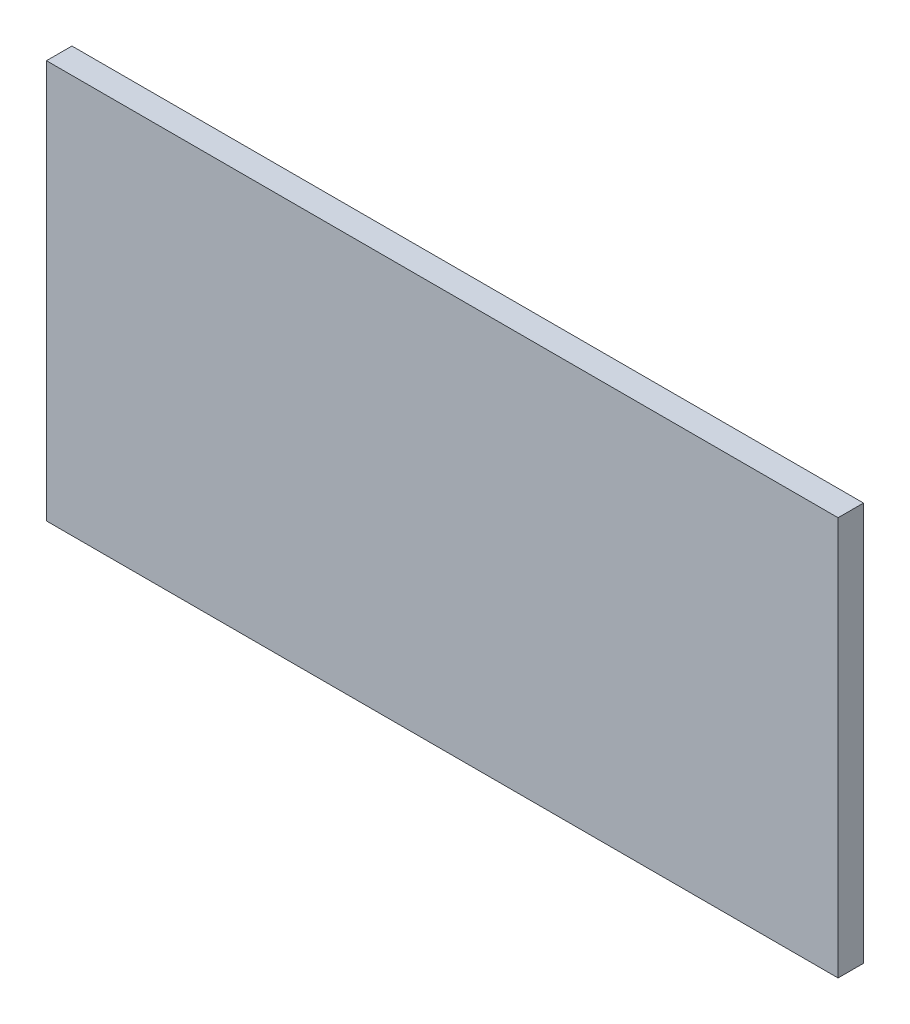
ISO-10303-21;
HEADER;
FILE_DESCRIPTION(('STEP AP214'),'2;1');
FILE_NAME('part.step','',(''),(''),'','','');
FILE_SCHEMA(('AUTOMOTIVE_DESIGN { 1 0 10303 214 1 1 1 1 }'));
ENDSEC;
DATA;
#1=APPLICATION_CONTEXT('core data for automotive mechanical design processes');
#2=APPLICATION_PROTOCOL_DEFINITION('international standard','automotive_design',2000,#1);
#3=PRODUCT_CONTEXT('',#1,'mechanical');
#4=PRODUCT('Part','Part','',(#3));
#5=PRODUCT_RELATED_PRODUCT_CATEGORY('part','',(#4));
#6=PRODUCT_DEFINITION_FORMATION('','',#4);
#7=PRODUCT_DEFINITION_CONTEXT('part definition',#1,'design');
#8=PRODUCT_DEFINITION('design','',#6,#7);
#9=PRODUCT_DEFINITION_SHAPE('','',#8);
#10=(LENGTH_UNIT() NAMED_UNIT(*) SI_UNIT(.MILLI.,.METRE.));
#11=(NAMED_UNIT(*) PLANE_ANGLE_UNIT() SI_UNIT($,.RADIAN.));
#12=(NAMED_UNIT(*) SI_UNIT($,.STERADIAN.) SOLID_ANGLE_UNIT());
#13=UNCERTAINTY_MEASURE_WITH_UNIT(LENGTH_MEASURE(1.E-05),#10,'distance_accuracy_value','');
#14=(GEOMETRIC_REPRESENTATION_CONTEXT(3) GLOBAL_UNCERTAINTY_ASSIGNED_CONTEXT((#13)) GLOBAL_UNIT_ASSIGNED_CONTEXT((#10,
#11,#12)) REPRESENTATION_CONTEXT('',''));
#15=CARTESIAN_POINT('',(0.,0.,0.));
#16=DIRECTION('',(0.,0.,1.));
#17=DIRECTION('',(1.,0.,0.));
#18=AXIS2_PLACEMENT_3D('',#15,#16,#17);
#19=CARTESIAN_POINT('',(-140.,0.,391.498006373246));
#20=DIRECTION('',(1.,0.,0.));
#21=DIRECTION('',(0.,0.,-1.));
#22=AXIS2_PLACEMENT_3D('',#19,#20,#21);
#23=PLANE('',#22);
#24=DIRECTION('',(0.,0.,-1.));
#25=VECTOR('',#24,1.);
#26=CARTESIAN_POINT('',(-140.,-66.,391.498006373246));
#27=LINE('',#26,#25);
#28=CARTESIAN_POINT('',(-140.,-66.,78.));
#29=VERTEX_POINT('',#28);
#30=CARTESIAN_POINT('',(-140.,-66.,69.));
#31=VERTEX_POINT('',#30);
#32=EDGE_CURVE('E70',#29,#31,#27,.T.);
#33=ORIENTED_EDGE('',*,*,#32,.F.);
#34=DIRECTION('',(0.,1.,0.));
#35=VECTOR('',#34,1.);
#36=CARTESIAN_POINT('',(-140.,0.,78.));
#37=LINE('',#36,#35);
#38=CARTESIAN_POINT('',(-140.,75.,78.));
#39=VERTEX_POINT('',#38);
#40=EDGE_CURVE('E40',#29,#39,#37,.T.);
#41=ORIENTED_EDGE('',*,*,#40,.T.);
#42=DIRECTION('',(0.,0.,-1.));
#43=VECTOR('',#42,1.);
#44=CARTESIAN_POINT('',(-140.,75.,391.498006373246));
#45=LINE('',#44,#43);
#46=CARTESIAN_POINT('',(-140.,75.,69.));
#47=VERTEX_POINT('',#46);
#48=EDGE_CURVE('E90',#39,#47,#45,.T.);
#49=ORIENTED_EDGE('',*,*,#48,.T.);
#50=DIRECTION('',(0.,-1.,0.));
#51=VECTOR('',#50,1.);
#52=CARTESIAN_POINT('',(-140.,0.,69.));
#53=LINE('',#52,#51);
#54=EDGE_CURVE('E84',#47,#31,#53,.T.);
#55=ORIENTED_EDGE('',*,*,#54,.T.);
#56=EDGE_LOOP('',(#33,#41,#49,#55));
#57=FACE_BOUND('',#56,.T.);
#58=ADVANCED_FACE('F33',(#57),#23,.F.);
#59=CARTESIAN_POINT('',(0.,-66.,391.498006373246));
#60=DIRECTION('',(0.,1.,0.));
#61=DIRECTION('',(0.,0.,1.));
#62=AXIS2_PLACEMENT_3D('',#59,#60,#61);
#63=PLANE('',#62);
#64=DIRECTION('',(0.,0.,-1.));
#65=VECTOR('',#64,1.);
#66=CARTESIAN_POINT('',(140.,-66.,391.498006373246));
#67=LINE('',#66,#65);
#68=CARTESIAN_POINT('',(140.,-66.,78.));
#69=VERTEX_POINT('',#68);
#70=CARTESIAN_POINT('',(140.,-66.,69.));
#71=VERTEX_POINT('',#70);
#72=EDGE_CURVE('E79',#69,#71,#67,.T.);
#73=ORIENTED_EDGE('',*,*,#72,.F.);
#74=DIRECTION('',(-1.,0.,0.));
#75=VECTOR('',#74,1.);
#76=CARTESIAN_POINT('',(0.,-66.,78.));
#77=LINE('',#76,#75);
#78=EDGE_CURVE('E47',#69,#29,#77,.T.);
#79=ORIENTED_EDGE('',*,*,#78,.T.);
#80=ORIENTED_EDGE('',*,*,#32,.T.);
#81=DIRECTION('',(1.,0.,0.));
#82=VECTOR('',#81,1.);
#83=CARTESIAN_POINT('',(0.,-66.,69.));
#84=LINE('',#83,#82);
#85=EDGE_CURVE('E74',#31,#71,#84,.T.);
#86=ORIENTED_EDGE('',*,*,#85,.T.);
#87=EDGE_LOOP('',(#73,#79,#80,#86));
#88=FACE_BOUND('',#87,.T.);
#89=ADVANCED_FACE('F73',(#88),#63,.F.);
#90=CARTESIAN_POINT('',(140.,0.,391.498006373246));
#91=DIRECTION('',(1.,0.,0.));
#92=DIRECTION('',(0.,0.,-1.));
#93=AXIS2_PLACEMENT_3D('',#90,#91,#92);
#94=PLANE('',#93);
#95=DIRECTION('',(0.,1.,0.));
#96=VECTOR('',#95,1.);
#97=CARTESIAN_POINT('',(140.,0.,78.));
#98=LINE('',#97,#96);
#99=CARTESIAN_POINT('',(140.,75.,78.));
#100=VERTEX_POINT('',#99);
#101=EDGE_CURVE('E78',#69,#100,#98,.T.);
#102=ORIENTED_EDGE('',*,*,#101,.F.);
#103=ORIENTED_EDGE('',*,*,#72,.T.);
#104=DIRECTION('',(0.,-1.,0.));
#105=VECTOR('',#104,1.);
#106=CARTESIAN_POINT('',(140.,0.,69.));
#107=LINE('',#106,#105);
#108=CARTESIAN_POINT('',(140.,75.,69.));
#109=VERTEX_POINT('',#108);
#110=EDGE_CURVE('E87',#109,#71,#107,.T.);
#111=ORIENTED_EDGE('',*,*,#110,.F.);
#112=DIRECTION('',(0.,0.,-1.));
#113=VECTOR('',#112,1.);
#114=CARTESIAN_POINT('',(140.,75.,391.498006373246));
#115=LINE('',#114,#113);
#116=EDGE_CURVE('E99',#100,#109,#115,.T.);
#117=ORIENTED_EDGE('',*,*,#116,.F.);
#118=EDGE_LOOP('',(#102,#103,#111,#117));
#119=FACE_BOUND('',#118,.T.);
#120=ADVANCED_FACE('F102',(#119),#94,.T.);
#121=CARTESIAN_POINT('',(0.,75.,391.498006373246));
#122=DIRECTION('',(0.,1.,0.));
#123=DIRECTION('',(0.,0.,1.));
#124=AXIS2_PLACEMENT_3D('',#121,#122,#123);
#125=PLANE('',#124);
#126=DIRECTION('',(-1.,0.,0.));
#127=VECTOR('',#126,1.);
#128=CARTESIAN_POINT('',(0.,75.,78.));
#129=LINE('',#128,#127);
#130=EDGE_CURVE('E11',#100,#39,#129,.T.);
#131=ORIENTED_EDGE('',*,*,#130,.F.);
#132=ORIENTED_EDGE('',*,*,#116,.T.);
#133=DIRECTION('',(1.,0.,0.));
#134=VECTOR('',#133,1.);
#135=CARTESIAN_POINT('',(0.,75.,69.));
#136=LINE('',#135,#134);
#137=EDGE_CURVE('E96',#47,#109,#136,.T.);
#138=ORIENTED_EDGE('',*,*,#137,.F.);
#139=ORIENTED_EDGE('',*,*,#48,.F.);
#140=EDGE_LOOP('',(#131,#132,#138,#139));
#141=FACE_BOUND('',#140,.T.);
#142=ADVANCED_FACE('F106',(#141),#125,.T.);
#143=CARTESIAN_POINT('',(0.,0.,69.));
#144=DIRECTION('',(0.,0.,1.));
#145=DIRECTION('',(1.,0.,0.));
#146=AXIS2_PLACEMENT_3D('',#143,#144,#145);
#147=PLANE('',#146);
#148=ORIENTED_EDGE('',*,*,#54,.F.);
#149=ORIENTED_EDGE('',*,*,#137,.T.);
#150=ORIENTED_EDGE('',*,*,#110,.T.);
#151=ORIENTED_EDGE('',*,*,#85,.F.);
#152=EDGE_LOOP('',(#148,#149,#150,#151));
#153=FACE_BOUND('',#152,.T.);
#154=ADVANCED_FACE('F82',(#153),#147,.F.);
#155=CARTESIAN_POINT('',(0.,0.,78.));
#156=DIRECTION('',(0.,0.,-1.));
#157=DIRECTION('',(-1.,0.,0.));
#158=AXIS2_PLACEMENT_3D('',#155,#156,#157);
#159=PLANE('',#158);
#160=ORIENTED_EDGE('',*,*,#78,.F.);
#161=ORIENTED_EDGE('',*,*,#101,.T.);
#162=ORIENTED_EDGE('',*,*,#130,.T.);
#163=ORIENTED_EDGE('',*,*,#40,.F.);
#164=EDGE_LOOP('',(#160,#161,#162,#163));
#165=FACE_BOUND('',#164,.T.);
#166=ADVANCED_FACE('F113',(#165),#159,.F.);
#167=CLOSED_SHELL('',(#58,#89,#120,#142,#154,#166));
#168=MANIFOLD_SOLID_BREP('B2',#167);
#169=ADVANCED_BREP_SHAPE_REPRESENTATION('',(#18,#168),#14);
#170=SHAPE_DEFINITION_REPRESENTATION(#9,#169);
ENDSEC;
END-ISO-10303-21;
